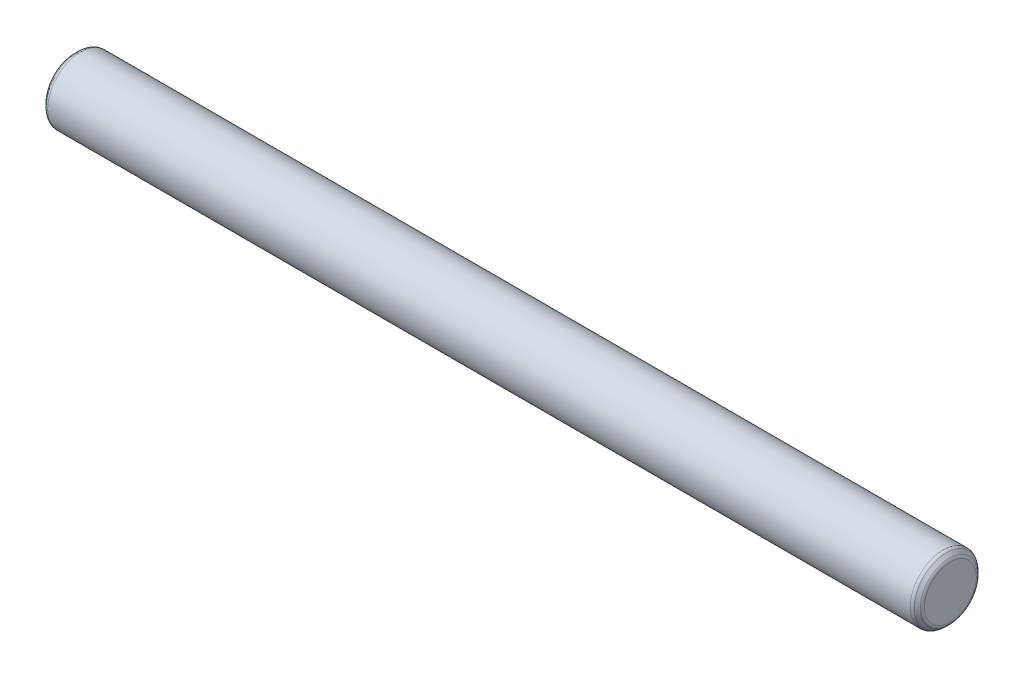
ISO-10303-21;
HEADER;
FILE_DESCRIPTION(('STEP AP214'),'2;1');
FILE_NAME('part.step','',(''),(''),'','','');
FILE_SCHEMA(('AUTOMOTIVE_DESIGN { 1 0 10303 214 1 1 1 1 }'));
ENDSEC;
DATA;
#1=APPLICATION_CONTEXT('core data for automotive mechanical design processes');
#2=APPLICATION_PROTOCOL_DEFINITION('international standard','automotive_design',2000,#1);
#3=PRODUCT_CONTEXT('',#1,'mechanical');
#4=PRODUCT('Part','Part','',(#3));
#5=PRODUCT_RELATED_PRODUCT_CATEGORY('part','',(#4));
#6=PRODUCT_DEFINITION_FORMATION('','',#4);
#7=PRODUCT_DEFINITION_CONTEXT('part definition',#1,'design');
#8=PRODUCT_DEFINITION('design','',#6,#7);
#9=PRODUCT_DEFINITION_SHAPE('','',#8);
#10=(LENGTH_UNIT() NAMED_UNIT(*) SI_UNIT(.MILLI.,.METRE.));
#11=(NAMED_UNIT(*) PLANE_ANGLE_UNIT() SI_UNIT($,.RADIAN.));
#12=(NAMED_UNIT(*) SI_UNIT($,.STERADIAN.) SOLID_ANGLE_UNIT());
#13=UNCERTAINTY_MEASURE_WITH_UNIT(LENGTH_MEASURE(1.E-05),#10,'distance_accuracy_value','');
#14=(GEOMETRIC_REPRESENTATION_CONTEXT(3) GLOBAL_UNCERTAINTY_ASSIGNED_CONTEXT((#13)) GLOBAL_UNIT_ASSIGNED_CONTEXT((#10,
#11,#12)) REPRESENTATION_CONTEXT('',''));
#15=CARTESIAN_POINT('',(0.,0.,0.));
#16=DIRECTION('',(0.,0.,1.));
#17=DIRECTION('',(1.,0.,0.));
#18=AXIS2_PLACEMENT_3D('',#15,#16,#17);
#19=CARTESIAN_POINT('',(82.55,0.,0.));
#20=DIRECTION('',(-1.,0.,0.));
#21=DIRECTION('',(0.,0.,1.));
#22=AXIS2_PLACEMENT_3D('',#19,#20,#21);
#23=CYLINDRICAL_SURFACE('',#22,3.1115);
#24=CARTESIAN_POINT('',(0.66581536726415,0.,0.));
#25=DIRECTION('',(-1.,0.,0.));
#26=DIRECTION('',(0.,0.,1.));
#27=AXIS2_PLACEMENT_3D('',#24,#25,#26);
#28=CIRCLE('',#27,3.1115);
#29=CARTESIAN_POINT('',(0.66581536726415,0.,3.1115));
#30=VERTEX_POINT('',#29);
#31=EDGE_CURVE('E52',#30,#30,#28,.F.);
#32=ORIENTED_EDGE('',*,*,#31,.T.);
#33=EDGE_LOOP('',(#32));
#34=FACE_BOUND('',#33,.T.);
#35=CARTESIAN_POINT('',(81.8841846327358,0.,0.));
#36=DIRECTION('',(1.,0.,0.));
#37=DIRECTION('',(0.,0.,-1.));
#38=AXIS2_PLACEMENT_3D('',#35,#36,#37);
#39=CIRCLE('',#38,3.1115);
#40=CARTESIAN_POINT('',(81.8841846327358,0.,-3.1115));
#41=VERTEX_POINT('',#40);
#42=EDGE_CURVE('E57',#41,#41,#39,.F.);
#43=ORIENTED_EDGE('',*,*,#42,.T.);
#44=EDGE_LOOP('',(#43));
#45=FACE_BOUND('',#44,.T.);
#46=ADVANCED_FACE('F37',(#34,#45),#23,.T.);
#47=CARTESIAN_POINT('',(82.55,0.,0.));
#48=DIRECTION('',(1.,0.,0.));
#49=DIRECTION('',(0.,0.,-1.));
#50=AXIS2_PLACEMENT_3D('',#47,#48,#49);
#51=PLANE('',#50);
#52=CARTESIAN_POINT('',(82.55,0.,0.));
#53=DIRECTION('',(1.,0.,0.));
#54=DIRECTION('',(0.,0.,-1.));
#55=AXIS2_PLACEMENT_3D('',#52,#53,#54);
#56=CIRCLE('',#55,2.44568463273584);
#57=CARTESIAN_POINT('',(82.55,0.,-2.44568463273584));
#58=VERTEX_POINT('',#57);
#59=EDGE_CURVE('E66',#58,#58,#56,.T.);
#60=ORIENTED_EDGE('',*,*,#59,.T.);
#61=EDGE_LOOP('',(#60));
#62=FACE_BOUND('',#61,.T.);
#63=ADVANCED_FACE('F70',(#62),#51,.T.);
#64=CARTESIAN_POINT('',(0.,0.,0.));
#65=DIRECTION('',(1.,0.,0.));
#66=DIRECTION('',(0.,0.,-1.));
#67=AXIS2_PLACEMENT_3D('',#64,#65,#66);
#68=PLANE('',#67);
#69=CARTESIAN_POINT('',(0.,0.,0.));
#70=DIRECTION('',(1.,0.,0.));
#71=DIRECTION('',(0.,0.,-1.));
#72=AXIS2_PLACEMENT_3D('',#69,#70,#71);
#73=CIRCLE('',#72,2.44568463273585);
#74=CARTESIAN_POINT('',(0.,0.,-2.44568463273585));
#75=VERTEX_POINT('',#74);
#76=EDGE_CURVE('E10',#75,#75,#73,.F.);
#77=ORIENTED_EDGE('',*,*,#76,.T.);
#78=EDGE_LOOP('',(#77));
#79=FACE_BOUND('',#78,.T.);
#80=ADVANCED_FACE('F94',(#79),#68,.F.);
#81=CARTESIAN_POINT('',(82.55,0.,0.));
#82=DIRECTION('',(-1.,0.,0.));
#83=DIRECTION('',(0.,0.,1.));
#84=AXIS2_PLACEMENT_3D('',#81,#82,#83);
#85=CONICAL_SURFACE('',#84,2.60349999999999,0.785398163397424);
#86=CARTESIAN_POINT('',(82.4384076836321,0.,0.));
#87=DIRECTION('',(1.,0.,0.));
#88=DIRECTION('',(0.,0.,-1.));
#89=AXIS2_PLACEMENT_3D('',#86,#87,#88);
#90=CIRCLE('',#89,2.71509231636792);
#91=CARTESIAN_POINT('',(82.4384076836321,0.,-2.71509231636792));
#92=VERTEX_POINT('',#91);
#93=EDGE_CURVE('E60',#92,#92,#90,.F.);
#94=ORIENTED_EDGE('',*,*,#93,.T.);
#95=EDGE_LOOP('',(#94));
#96=FACE_BOUND('',#95,.T.);
#97=CARTESIAN_POINT('',(82.1535923163679,0.,0.));
#98=DIRECTION('',(-1.,0.,0.));
#99=DIRECTION('',(0.,0.,1.));
#100=AXIS2_PLACEMENT_3D('',#97,#98,#99);
#101=CIRCLE('',#100,2.99990768363208);
#102=CARTESIAN_POINT('',(82.1535923163679,0.,2.99990768363208));
#103=VERTEX_POINT('',#102);
#104=EDGE_CURVE('E63',#103,#103,#101,.F.);
#105=ORIENTED_EDGE('',*,*,#104,.T.);
#106=EDGE_LOOP('',(#105));
#107=FACE_BOUND('',#106,.T.);
#108=ADVANCED_FACE('F85',(#96,#107),#85,.T.);
#109=CARTESIAN_POINT('',(0.508000000000008,0.,0.));
#110=DIRECTION('',(1.,0.,0.));
#111=DIRECTION('',(0.,0.,-1.));
#112=AXIS2_PLACEMENT_3D('',#109,#110,#111);
#113=CONICAL_SURFACE('',#112,3.1115,0.785398163397438);
#114=CARTESIAN_POINT('',(0.396407683632081,0.,0.));
#115=DIRECTION('',(1.,0.,0.));
#116=DIRECTION('',(0.,0.,-1.));
#117=AXIS2_PLACEMENT_3D('',#114,#115,#116);
#118=CIRCLE('',#117,2.99990768363207);
#119=CARTESIAN_POINT('',(0.396407683632081,0.,-2.99990768363207));
#120=VERTEX_POINT('',#119);
#121=EDGE_CURVE('E44',#120,#120,#118,.F.);
#122=ORIENTED_EDGE('',*,*,#121,.T.);
#123=EDGE_LOOP('',(#122));
#124=FACE_BOUND('',#123,.T.);
#125=CARTESIAN_POINT('',(0.111592316367928,0.,0.));
#126=DIRECTION('',(1.,0.,0.));
#127=DIRECTION('',(0.,0.,-1.));
#128=AXIS2_PLACEMENT_3D('',#125,#126,#127);
#129=CIRCLE('',#128,2.71509231636793);
#130=CARTESIAN_POINT('',(0.111592316367928,0.,-2.71509231636793));
#131=VERTEX_POINT('',#130);
#132=EDGE_CURVE('E48',#131,#131,#129,.T.);
#133=ORIENTED_EDGE('',*,*,#132,.T.);
#134=EDGE_LOOP('',(#133));
#135=FACE_BOUND('',#134,.T.);
#136=ADVANCED_FACE('F75',(#124,#135),#113,.T.);
#137=CARTESIAN_POINT('',(82.169,0.,0.));
#138=DIRECTION('',(1.,0.,0.));
#139=DIRECTION('',(0.,0.,-1.));
#140=AXIS2_PLACEMENT_3D('',#137,#138,#139);
#141=TOROIDAL_SURFACE('',#140,2.44568463273584,0.381);
#142=ORIENTED_EDGE('',*,*,#93,.F.);
#143=EDGE_LOOP('',(#142));
#144=FACE_BOUND('',#143,.T.);
#145=ORIENTED_EDGE('',*,*,#59,.F.);
#146=EDGE_LOOP('',(#145));
#147=FACE_BOUND('',#146,.T.);
#148=ADVANCED_FACE('F72',(#144,#147),#141,.T.);
#149=CARTESIAN_POINT('',(0.66581536726415,0.,0.));
#150=DIRECTION('',(-1.,0.,0.));
#151=DIRECTION('',(0.,0.,1.));
#152=AXIS2_PLACEMENT_3D('',#149,#150,#151);
#153=TOROIDAL_SURFACE('',#152,2.7305,0.381);
#154=ORIENTED_EDGE('',*,*,#121,.F.);
#155=EDGE_LOOP('',(#154));
#156=FACE_BOUND('',#155,.T.);
#157=ORIENTED_EDGE('',*,*,#31,.F.);
#158=EDGE_LOOP('',(#157));
#159=FACE_BOUND('',#158,.T.);
#160=ADVANCED_FACE('F74',(#156,#159),#153,.T.);
#161=CARTESIAN_POINT('',(0.381,0.,0.));
#162=DIRECTION('',(1.,0.,0.));
#163=DIRECTION('',(0.,0.,-1.));
#164=AXIS2_PLACEMENT_3D('',#161,#162,#163);
#165=TOROIDAL_SURFACE('',#164,2.44568463273585,0.381);
#166=ORIENTED_EDGE('',*,*,#132,.F.);
#167=EDGE_LOOP('',(#166));
#168=FACE_BOUND('',#167,.T.);
#169=ORIENTED_EDGE('',*,*,#76,.F.);
#170=EDGE_LOOP('',(#169));
#171=FACE_BOUND('',#170,.T.);
#172=ADVANCED_FACE('F82',(#168,#171),#165,.T.);
#173=CARTESIAN_POINT('',(81.8841846327358,0.,0.));
#174=DIRECTION('',(1.,0.,0.));
#175=DIRECTION('',(0.,0.,-1.));
#176=AXIS2_PLACEMENT_3D('',#173,#174,#175);
#177=TOROIDAL_SURFACE('',#176,2.7305,0.381);
#178=ORIENTED_EDGE('',*,*,#104,.F.);
#179=EDGE_LOOP('',(#178));
#180=FACE_BOUND('',#179,.T.);
#181=ORIENTED_EDGE('',*,*,#42,.F.);
#182=EDGE_LOOP('',(#181));
#183=FACE_BOUND('',#182,.T.);
#184=ADVANCED_FACE('F39',(#180,#183),#177,.T.);
#185=CLOSED_SHELL('',(#46,#63,#80,#108,#136,#148,#160,#172,#184));
#186=MANIFOLD_SOLID_BREP('B2',#185);
#187=ADVANCED_BREP_SHAPE_REPRESENTATION('',(#18,#186),#14);
#188=SHAPE_DEFINITION_REPRESENTATION(#9,#187);
ENDSEC;
END-ISO-10303-21;
